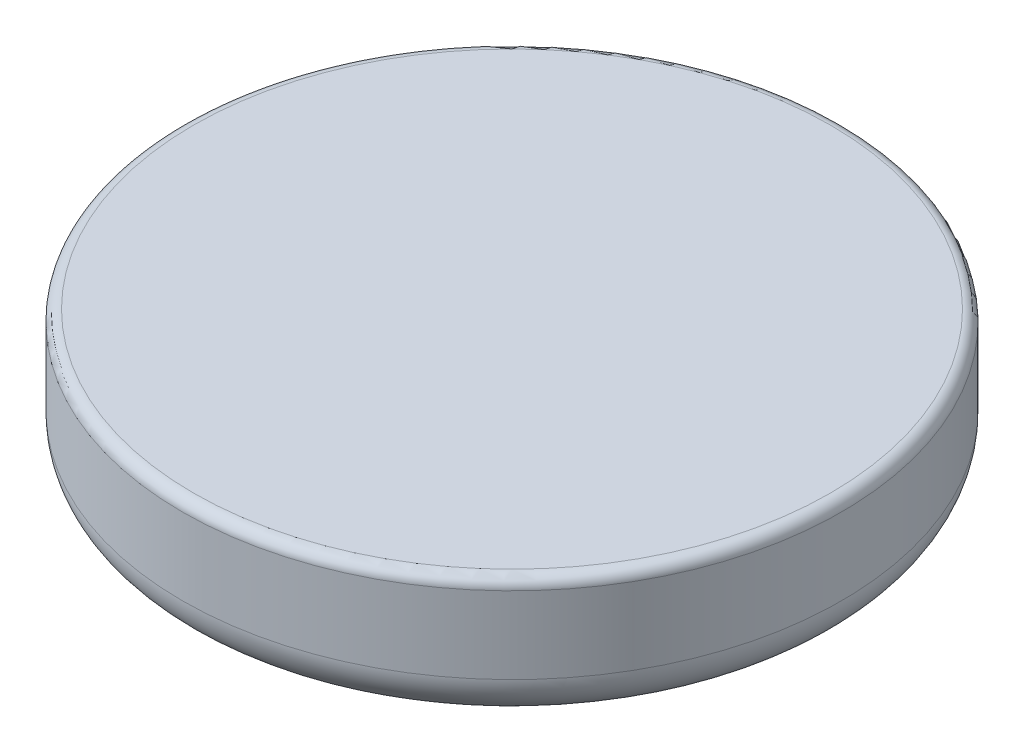
ISO-10303-21;
HEADER;
FILE_DESCRIPTION(('STEP AP214'),'2;1');
FILE_NAME('part.step','',(''),(''),'','','');
FILE_SCHEMA(('AUTOMOTIVE_DESIGN { 1 0 10303 214 1 1 1 1 }'));
ENDSEC;
DATA;
#1=APPLICATION_CONTEXT('core data for automotive mechanical design processes');
#2=APPLICATION_PROTOCOL_DEFINITION('international standard','automotive_design',2000,#1);
#3=PRODUCT_CONTEXT('',#1,'mechanical');
#4=PRODUCT('Part','Part','',(#3));
#5=PRODUCT_RELATED_PRODUCT_CATEGORY('part','',(#4));
#6=PRODUCT_DEFINITION_FORMATION('','',#4);
#7=PRODUCT_DEFINITION_CONTEXT('part definition',#1,'design');
#8=PRODUCT_DEFINITION('design','',#6,#7);
#9=PRODUCT_DEFINITION_SHAPE('','',#8);
#10=(LENGTH_UNIT() NAMED_UNIT(*) SI_UNIT(.MILLI.,.METRE.));
#11=(NAMED_UNIT(*) PLANE_ANGLE_UNIT() SI_UNIT($,.RADIAN.));
#12=(NAMED_UNIT(*) SI_UNIT($,.STERADIAN.) SOLID_ANGLE_UNIT());
#13=UNCERTAINTY_MEASURE_WITH_UNIT(LENGTH_MEASURE(1.E-05),#10,'distance_accuracy_value','');
#14=(GEOMETRIC_REPRESENTATION_CONTEXT(3) GLOBAL_UNCERTAINTY_ASSIGNED_CONTEXT((#13)) GLOBAL_UNIT_ASSIGNED_CONTEXT((#10,
#11,#12)) REPRESENTATION_CONTEXT('',''));
#15=CARTESIAN_POINT('',(0.,0.,0.));
#16=DIRECTION('',(0.,0.,1.));
#17=DIRECTION('',(1.,0.,0.));
#18=AXIS2_PLACEMENT_3D('',#15,#16,#17);
#19=CARTESIAN_POINT('',(0.,3.,0.));
#20=DIRECTION('',(0.,-1.,0.));
#21=DIRECTION('',(0.,0.,-1.));
#22=AXIS2_PLACEMENT_3D('',#19,#20,#21);
#23=CYLINDRICAL_SURFACE('',#22,7.5);
#24=CARTESIAN_POINT('',(0.,2.75,0.));
#25=DIRECTION('',(0.,1.,0.));
#26=DIRECTION('',(0.,0.,1.));
#27=AXIS2_PLACEMENT_3D('',#24,#25,#26);
#28=CIRCLE('',#27,7.5);
#29=CARTESIAN_POINT('',(0.,2.75,7.5));
#30=VERTEX_POINT('',#29);
#31=EDGE_CURVE('E350',#30,#30,#28,.F.);
#32=ORIENTED_EDGE('',*,*,#31,.T.);
#33=EDGE_LOOP('',(#32));
#34=FACE_BOUND('',#33,.T.);
#35=CARTESIAN_POINT('',(0.,1.,0.));
#36=DIRECTION('',(0.,1.,0.));
#37=DIRECTION('',(0.,0.,1.));
#38=AXIS2_PLACEMENT_3D('',#35,#36,#37);
#39=CIRCLE('',#38,7.5);
#40=CARTESIAN_POINT('',(0.,1.,7.5));
#41=VERTEX_POINT('',#40);
#42=EDGE_CURVE('E253',#41,#41,#39,.T.);
#43=ORIENTED_EDGE('',*,*,#42,.T.);
#44=EDGE_LOOP('',(#43));
#45=FACE_BOUND('',#44,.T.);
#46=ADVANCED_FACE('F43',(#34,#45),#23,.T.);
#47=CARTESIAN_POINT('',(0.,3.,0.));
#48=DIRECTION('',(0.,1.,0.));
#49=DIRECTION('',(0.,0.,1.));
#50=AXIS2_PLACEMENT_3D('',#47,#48,#49);
#51=PLANE('',#50);
#52=CARTESIAN_POINT('',(0.,3.,0.));
#53=DIRECTION('',(0.,1.,0.));
#54=DIRECTION('',(0.,0.,1.));
#55=AXIS2_PLACEMENT_3D('',#52,#53,#54);
#56=CIRCLE('',#55,7.25);
#57=CARTESIAN_POINT('',(0.,3.,7.25));
#58=VERTEX_POINT('',#57);
#59=EDGE_CURVE('E346',#58,#58,#56,.T.);
#60=ORIENTED_EDGE('',*,*,#59,.T.);
#61=EDGE_LOOP('',(#60));
#62=FACE_BOUND('',#61,.T.);
#63=ADVANCED_FACE('F459',(#62),#51,.T.);
#64=CARTESIAN_POINT('',(0.,0.,0.));
#65=DIRECTION('',(0.,1.,0.));
#66=DIRECTION('',(0.,0.,1.));
#67=AXIS2_PLACEMENT_3D('',#64,#65,#66);
#68=PLANE('',#67);
#69=DIRECTION('',(0.,0.,1.));
#70=VECTOR('',#69,1.);
#71=CARTESIAN_POINT('',(2.55,0.,0.700000000000001));
#72=LINE('',#71,#70);
#73=CARTESIAN_POINT('',(2.55,0.,-0.95));
#74=VERTEX_POINT('',#73);
#75=CARTESIAN_POINT('',(2.55,0.,0.950000000000001));
#76=VERTEX_POINT('',#75);
#77=EDGE_CURVE('E244',#74,#76,#72,.T.);
#78=ORIENTED_EDGE('',*,*,#77,.F.);
#79=DIRECTION('',(1.,0.,0.));
#80=VECTOR('',#79,1.);
#81=CARTESIAN_POINT('',(0.,0.,-0.95));
#82=LINE('',#81,#80);
#83=CARTESIAN_POINT('',(0.95,0.,-0.95));
#84=VERTEX_POINT('',#83);
#85=EDGE_CURVE('E325',#74,#84,#82,.F.);
#86=ORIENTED_EDGE('',*,*,#85,.T.);
#87=DIRECTION('',(0.,0.,1.));
#88=VECTOR('',#87,1.);
#89=CARTESIAN_POINT('',(0.95,0.,0.));
#90=LINE('',#89,#88);
#91=CARTESIAN_POINT('',(0.95,0.,-2.55));
#92=VERTEX_POINT('',#91);
#93=EDGE_CURVE('E321',#84,#92,#90,.F.);
#94=ORIENTED_EDGE('',*,*,#93,.T.);
#95=DIRECTION('',(1.,0.,0.));
#96=VECTOR('',#95,1.);
#97=CARTESIAN_POINT('',(0.7,0.,-2.55));
#98=LINE('',#97,#96);
#99=CARTESIAN_POINT('',(-0.95,0.,-2.55));
#100=VERTEX_POINT('',#99);
#101=EDGE_CURVE('E241',#100,#92,#98,.T.);
#102=ORIENTED_EDGE('',*,*,#101,.F.);
#103=DIRECTION('',(0.,0.,-1.));
#104=VECTOR('',#103,1.);
#105=CARTESIAN_POINT('',(-0.95,0.,0.));
#106=LINE('',#105,#104);
#107=CARTESIAN_POINT('',(-0.95,0.,-0.95));
#108=VERTEX_POINT('',#107);
#109=EDGE_CURVE('E314',#100,#108,#106,.F.);
#110=ORIENTED_EDGE('',*,*,#109,.T.);
#111=DIRECTION('',(1.,0.,0.));
#112=VECTOR('',#111,1.);
#113=CARTESIAN_POINT('',(0.,0.,-0.95));
#114=LINE('',#113,#112);
#115=CARTESIAN_POINT('',(-2.55,0.,-0.95));
#116=VERTEX_POINT('',#115);
#117=EDGE_CURVE('E317',#108,#116,#114,.F.);
#118=ORIENTED_EDGE('',*,*,#117,.T.);
#119=DIRECTION('',(0.,0.,-1.));
#120=VECTOR('',#119,1.);
#121=CARTESIAN_POINT('',(-2.55,0.,0.700000000000001));
#122=LINE('',#121,#120);
#123=CARTESIAN_POINT('',(-2.55,0.,0.950000000000001));
#124=VERTEX_POINT('',#123);
#125=EDGE_CURVE('E200',#124,#116,#122,.T.);
#126=ORIENTED_EDGE('',*,*,#125,.F.);
#127=DIRECTION('',(-1.,0.,0.));
#128=VECTOR('',#127,1.);
#129=CARTESIAN_POINT('',(0.,0.,0.950000000000001));
#130=LINE('',#129,#128);
#131=CARTESIAN_POINT('',(-0.95,0.,0.950000000000001));
#132=VERTEX_POINT('',#131);
#133=EDGE_CURVE('E311',#124,#132,#130,.F.);
#134=ORIENTED_EDGE('',*,*,#133,.T.);
#135=DIRECTION('',(0.,0.,-1.));
#136=VECTOR('',#135,1.);
#137=CARTESIAN_POINT('',(-0.95,0.,0.));
#138=LINE('',#137,#136);
#139=CARTESIAN_POINT('',(-0.950000000000001,0.,2.55));
#140=VERTEX_POINT('',#139);
#141=EDGE_CURVE('E307',#132,#140,#138,.F.);
#142=ORIENTED_EDGE('',*,*,#141,.T.);
#143=DIRECTION('',(-1.,0.,0.));
#144=VECTOR('',#143,1.);
#145=CARTESIAN_POINT('',(0.7,0.,2.55));
#146=LINE('',#145,#144);
#147=CARTESIAN_POINT('',(0.95,0.,2.55));
#148=VERTEX_POINT('',#147);
#149=EDGE_CURVE('E203',#148,#140,#146,.T.);
#150=ORIENTED_EDGE('',*,*,#149,.F.);
#151=DIRECTION('',(0.,0.,1.));
#152=VECTOR('',#151,1.);
#153=CARTESIAN_POINT('',(0.95,0.,0.));
#154=LINE('',#153,#152);
#155=CARTESIAN_POINT('',(0.95,0.,0.950000000000001));
#156=VERTEX_POINT('',#155);
#157=EDGE_CURVE('E300',#148,#156,#154,.F.);
#158=ORIENTED_EDGE('',*,*,#157,.T.);
#159=DIRECTION('',(-1.,0.,0.));
#160=VECTOR('',#159,1.);
#161=CARTESIAN_POINT('',(0.,0.,0.950000000000001));
#162=LINE('',#161,#160);
#163=EDGE_CURVE('E303',#156,#76,#162,.F.);
#164=ORIENTED_EDGE('',*,*,#163,.T.);
#165=EDGE_LOOP('',(#78,#86,#94,#102,#110,#118,#126,#134,#142,#150,#158,#164));
#166=FACE_BOUND('',#165,.T.);
#167=CARTESIAN_POINT('',(0.,0.,0.));
#168=DIRECTION('',(0.,1.,0.));
#169=DIRECTION('',(0.,0.,1.));
#170=AXIS2_PLACEMENT_3D('',#167,#168,#169);
#171=CIRCLE('',#170,6.5);
#172=CARTESIAN_POINT('',(0.,0.,6.5));
#173=VERTEX_POINT('',#172);
#174=EDGE_CURVE('E292',#173,#173,#171,.F.);
#175=ORIENTED_EDGE('',*,*,#174,.T.);
#176=EDGE_LOOP('',(#175));
#177=FACE_BOUND('',#176,.T.);
#178=ADVANCED_FACE('F403',(#166,#177),#68,.F.);
#179=CARTESIAN_POINT('',(0.,1.,0.));
#180=DIRECTION('',(0.,1.,0.));
#181=DIRECTION('',(0.,0.,1.));
#182=AXIS2_PLACEMENT_3D('',#179,#180,#181);
#183=TOROIDAL_SURFACE('',#182,6.5,1.);
#184=ORIENTED_EDGE('',*,*,#174,.F.);
#185=EDGE_LOOP('',(#184));
#186=FACE_BOUND('',#185,.T.);
#187=ORIENTED_EDGE('',*,*,#42,.F.);
#188=EDGE_LOOP('',(#187));
#189=FACE_BOUND('',#188,.T.);
#190=ADVANCED_FACE('F469',(#186,#189),#183,.T.);
#191=CARTESIAN_POINT('',(0.7,2.,-2.55));
#192=DIRECTION('',(0.,0.,-1.));
#193=DIRECTION('',(-1.,0.,0.));
#194=AXIS2_PLACEMENT_3D('',#191,#192,#193);
#195=PLANE('',#194);
#196=ORIENTED_EDGE('',*,*,#101,.T.);
#197=CARTESIAN_POINT('',(0.95,0.25,-2.55));
#198=DIRECTION('',(0.,0.,-1.));
#199=DIRECTION('',(-1.,0.,0.));
#200=AXIS2_PLACEMENT_3D('',#197,#198,#199);
#201=CIRCLE('',#200,0.25);
#202=CARTESIAN_POINT('',(0.7,0.25,-2.55));
#203=VERTEX_POINT('',#202);
#204=EDGE_CURVE('E179',#92,#203,#201,.T.);
#205=ORIENTED_EDGE('',*,*,#204,.T.);
#206=DIRECTION('',(0.,-1.,0.));
#207=VECTOR('',#206,1.);
#208=CARTESIAN_POINT('',(0.7,2.,-2.55));
#209=LINE('',#208,#207);
#210=CARTESIAN_POINT('',(0.7,2.,-2.55));
#211=VERTEX_POINT('',#210);
#212=EDGE_CURVE('E171',#211,#203,#209,.T.);
#213=ORIENTED_EDGE('',*,*,#212,.F.);
#214=DIRECTION('',(1.,0.,0.));
#215=VECTOR('',#214,1.);
#216=CARTESIAN_POINT('',(0.7,2.,-2.55));
#217=LINE('',#216,#215);
#218=CARTESIAN_POINT('',(-0.7,2.,-2.55));
#219=VERTEX_POINT('',#218);
#220=EDGE_CURVE('E176',#219,#211,#217,.T.);
#221=ORIENTED_EDGE('',*,*,#220,.F.);
#222=DIRECTION('',(0.,-1.,0.));
#223=VECTOR('',#222,1.);
#224=CARTESIAN_POINT('',(-0.7,2.,-2.55));
#225=LINE('',#224,#223);
#226=CARTESIAN_POINT('',(-0.7,0.25,-2.55));
#227=VERTEX_POINT('',#226);
#228=EDGE_CURVE('E250',#219,#227,#225,.T.);
#229=ORIENTED_EDGE('',*,*,#228,.T.);
#230=CARTESIAN_POINT('',(-0.95,0.25,-2.55));
#231=DIRECTION('',(0.,0.,-1.));
#232=DIRECTION('',(-1.,0.,0.));
#233=AXIS2_PLACEMENT_3D('',#230,#231,#232);
#234=CIRCLE('',#233,0.25);
#235=EDGE_CURVE('E375',#227,#100,#234,.T.);
#236=ORIENTED_EDGE('',*,*,#235,.T.);
#237=EDGE_LOOP('',(#196,#205,#213,#221,#229,#236));
#238=FACE_BOUND('',#237,.T.);
#239=ADVANCED_FACE('F173',(#238),#195,.F.);
#240=CARTESIAN_POINT('',(-0.7,2.,-0.7));
#241=DIRECTION('',(-1.,0.,0.));
#242=DIRECTION('',(0.,0.,1.));
#243=AXIS2_PLACEMENT_3D('',#240,#241,#242);
#244=PLANE('',#243);
#245=DIRECTION('',(0.,-1.,0.));
#246=VECTOR('',#245,1.);
#247=CARTESIAN_POINT('',(-0.7,2.,-0.7));
#248=LINE('',#247,#246);
#249=CARTESIAN_POINT('',(-0.7,2.,-0.7));
#250=VERTEX_POINT('',#249);
#251=CARTESIAN_POINT('',(-0.7,0.25,-0.7));
#252=VERTEX_POINT('',#251);
#253=EDGE_CURVE('E254',#250,#252,#248,.T.);
#254=ORIENTED_EDGE('',*,*,#253,.T.);
#255=DIRECTION('',(0.,0.,-1.));
#256=VECTOR('',#255,1.);
#257=CARTESIAN_POINT('',(-0.7,0.25,-0.7));
#258=LINE('',#257,#256);
#259=EDGE_CURVE('E343',#252,#227,#258,.T.);
#260=ORIENTED_EDGE('',*,*,#259,.T.);
#261=ORIENTED_EDGE('',*,*,#228,.F.);
#262=DIRECTION('',(0.,0.,-1.));
#263=VECTOR('',#262,1.);
#264=CARTESIAN_POINT('',(-0.7,2.,-0.7));
#265=LINE('',#264,#263);
#266=EDGE_CURVE('E184',#250,#219,#265,.T.);
#267=ORIENTED_EDGE('',*,*,#266,.F.);
#268=EDGE_LOOP('',(#254,#260,#261,#267));
#269=FACE_BOUND('',#268,.T.);
#270=ADVANCED_FACE('F436',(#269),#244,.F.);
#271=CARTESIAN_POINT('',(-0.7,2.,-0.7));
#272=DIRECTION('',(0.,0.,-1.));
#273=DIRECTION('',(-1.,0.,0.));
#274=AXIS2_PLACEMENT_3D('',#271,#272,#273);
#275=PLANE('',#274);
#276=DIRECTION('',(0.,-1.,0.));
#277=VECTOR('',#276,1.);
#278=CARTESIAN_POINT('',(-2.55,2.,-0.7));
#279=LINE('',#278,#277);
#280=CARTESIAN_POINT('',(-2.55,2.,-0.7));
#281=VERTEX_POINT('',#280);
#282=CARTESIAN_POINT('',(-2.55,0.25,-0.7));
#283=VERTEX_POINT('',#282);
#284=EDGE_CURVE('E258',#281,#283,#279,.T.);
#285=ORIENTED_EDGE('',*,*,#284,.T.);
#286=DIRECTION('',(1.,0.,0.));
#287=VECTOR('',#286,1.);
#288=CARTESIAN_POINT('',(-0.7,0.25,-0.7));
#289=LINE('',#288,#287);
#290=EDGE_CURVE('E296',#283,#252,#289,.T.);
#291=ORIENTED_EDGE('',*,*,#290,.T.);
#292=ORIENTED_EDGE('',*,*,#253,.F.);
#293=DIRECTION('',(1.,0.,0.));
#294=VECTOR('',#293,1.);
#295=CARTESIAN_POINT('',(-0.7,2.,-0.7));
#296=LINE('',#295,#294);
#297=EDGE_CURVE('E236',#281,#250,#296,.T.);
#298=ORIENTED_EDGE('',*,*,#297,.F.);
#299=EDGE_LOOP('',(#285,#291,#292,#298));
#300=FACE_BOUND('',#299,.T.);
#301=ADVANCED_FACE('F434',(#300),#275,.F.);
#302=CARTESIAN_POINT('',(-2.55,2.,0.700000000000001));
#303=DIRECTION('',(-1.,0.,0.));
#304=DIRECTION('',(0.,0.,1.));
#305=AXIS2_PLACEMENT_3D('',#302,#303,#304);
#306=PLANE('',#305);
#307=ORIENTED_EDGE('',*,*,#125,.T.);
#308=CARTESIAN_POINT('',(-2.55,0.25,-0.95));
#309=DIRECTION('',(-1.,0.,0.));
#310=DIRECTION('',(0.,0.,1.));
#311=AXIS2_PLACEMENT_3D('',#308,#309,#310);
#312=CIRCLE('',#311,0.25);
#313=EDGE_CURVE('E359',#116,#283,#312,.T.);
#314=ORIENTED_EDGE('',*,*,#313,.T.);
#315=ORIENTED_EDGE('',*,*,#284,.F.);
#316=DIRECTION('',(0.,0.,-1.));
#317=VECTOR('',#316,1.);
#318=CARTESIAN_POINT('',(-2.55,2.,0.700000000000001));
#319=LINE('',#318,#317);
#320=CARTESIAN_POINT('',(-2.55,2.,0.700000000000001));
#321=VERTEX_POINT('',#320);
#322=EDGE_CURVE('E232',#321,#281,#319,.T.);
#323=ORIENTED_EDGE('',*,*,#322,.F.);
#324=DIRECTION('',(0.,-1.,0.));
#325=VECTOR('',#324,1.);
#326=CARTESIAN_POINT('',(-2.55,2.,0.700000000000001));
#327=LINE('',#326,#325);
#328=CARTESIAN_POINT('',(-2.55,0.25,0.700000000000001));
#329=VERTEX_POINT('',#328);
#330=EDGE_CURVE('E262',#321,#329,#327,.T.);
#331=ORIENTED_EDGE('',*,*,#330,.T.);
#332=CARTESIAN_POINT('',(-2.55,0.25,0.950000000000001));
#333=DIRECTION('',(-1.,0.,0.));
#334=DIRECTION('',(0.,0.,1.));
#335=AXIS2_PLACEMENT_3D('',#332,#333,#334);
#336=CIRCLE('',#335,0.25);
#337=EDGE_CURVE('E362',#329,#124,#336,.T.);
#338=ORIENTED_EDGE('',*,*,#337,.T.);
#339=EDGE_LOOP('',(#307,#314,#315,#323,#331,#338));
#340=FACE_BOUND('',#339,.T.);
#341=ADVANCED_FACE('F430',(#340),#306,.F.);
#342=CARTESIAN_POINT('',(-0.7,2.,0.700000000000001));
#343=DIRECTION('',(0.,0.,1.));
#344=DIRECTION('',(1.,0.,0.));
#345=AXIS2_PLACEMENT_3D('',#342,#343,#344);
#346=PLANE('',#345);
#347=DIRECTION('',(0.,-1.,0.));
#348=VECTOR('',#347,1.);
#349=CARTESIAN_POINT('',(-0.7,2.,0.700000000000001));
#350=LINE('',#349,#348);
#351=CARTESIAN_POINT('',(-0.7,2.,0.700000000000001));
#352=VERTEX_POINT('',#351);
#353=CARTESIAN_POINT('',(-0.7,0.25,0.700000000000001));
#354=VERTEX_POINT('',#353);
#355=EDGE_CURVE('E266',#352,#354,#350,.T.);
#356=ORIENTED_EDGE('',*,*,#355,.T.);
#357=DIRECTION('',(-1.,0.,0.));
#358=VECTOR('',#357,1.);
#359=CARTESIAN_POINT('',(-0.7,0.25,0.700000000000001));
#360=LINE('',#359,#358);
#361=EDGE_CURVE('E328',#354,#329,#360,.T.);
#362=ORIENTED_EDGE('',*,*,#361,.T.);
#363=ORIENTED_EDGE('',*,*,#330,.F.);
#364=DIRECTION('',(-1.,0.,0.));
#365=VECTOR('',#364,1.);
#366=CARTESIAN_POINT('',(-0.7,2.,0.700000000000001));
#367=LINE('',#366,#365);
#368=EDGE_CURVE('E228',#352,#321,#367,.T.);
#369=ORIENTED_EDGE('',*,*,#368,.F.);
#370=EDGE_LOOP('',(#356,#362,#363,#369));
#371=FACE_BOUND('',#370,.T.);
#372=ADVANCED_FACE('F426',(#371),#346,.F.);
#373=CARTESIAN_POINT('',(-0.700000000000001,2.,2.55));
#374=DIRECTION('',(-1.,0.,0.));
#375=DIRECTION('',(0.,0.,1.));
#376=AXIS2_PLACEMENT_3D('',#373,#374,#375);
#377=PLANE('',#376);
#378=DIRECTION('',(0.,-1.,0.));
#379=VECTOR('',#378,1.);
#380=CARTESIAN_POINT('',(-0.700000000000001,2.,2.55));
#381=LINE('',#380,#379);
#382=CARTESIAN_POINT('',(-0.700000000000001,2.,2.55));
#383=VERTEX_POINT('',#382);
#384=CARTESIAN_POINT('',(-0.700000000000001,0.25,2.55));
#385=VERTEX_POINT('',#384);
#386=EDGE_CURVE('E270',#383,#385,#381,.T.);
#387=ORIENTED_EDGE('',*,*,#386,.T.);
#388=DIRECTION('',(0.,0.,-1.));
#389=VECTOR('',#388,1.);
#390=CARTESIAN_POINT('',(-0.700000000000001,0.25,2.55));
#391=LINE('',#390,#389);
#392=EDGE_CURVE('E354',#385,#354,#391,.T.);
#393=ORIENTED_EDGE('',*,*,#392,.T.);
#394=ORIENTED_EDGE('',*,*,#355,.F.);
#395=DIRECTION('',(0.,0.,-1.));
#396=VECTOR('',#395,1.);
#397=CARTESIAN_POINT('',(-0.700000000000001,2.,2.55));
#398=LINE('',#397,#396);
#399=EDGE_CURVE('E224',#383,#352,#398,.T.);
#400=ORIENTED_EDGE('',*,*,#399,.F.);
#401=EDGE_LOOP('',(#387,#393,#394,#400));
#402=FACE_BOUND('',#401,.T.);
#403=ADVANCED_FACE('F422',(#402),#377,.F.);
#404=CARTESIAN_POINT('',(0.7,2.,2.55));
#405=DIRECTION('',(0.,0.,1.));
#406=DIRECTION('',(1.,0.,0.));
#407=AXIS2_PLACEMENT_3D('',#404,#405,#406);
#408=PLANE('',#407);
#409=ORIENTED_EDGE('',*,*,#149,.T.);
#410=CARTESIAN_POINT('',(-0.950000000000001,0.25,2.55));
#411=DIRECTION('',(0.,0.,1.));
#412=DIRECTION('',(1.,0.,0.));
#413=AXIS2_PLACEMENT_3D('',#410,#411,#412);
#414=CIRCLE('',#413,0.25);
#415=EDGE_CURVE('E53',#140,#385,#414,.T.);
#416=ORIENTED_EDGE('',*,*,#415,.T.);
#417=ORIENTED_EDGE('',*,*,#386,.F.);
#418=DIRECTION('',(-1.,0.,0.));
#419=VECTOR('',#418,1.);
#420=CARTESIAN_POINT('',(0.7,2.,2.55));
#421=LINE('',#420,#419);
#422=CARTESIAN_POINT('',(0.7,2.,2.55));
#423=VERTEX_POINT('',#422);
#424=EDGE_CURVE('E220',#423,#383,#421,.T.);
#425=ORIENTED_EDGE('',*,*,#424,.F.);
#426=DIRECTION('',(0.,-1.,0.));
#427=VECTOR('',#426,1.);
#428=CARTESIAN_POINT('',(0.7,2.,2.55));
#429=LINE('',#428,#427);
#430=CARTESIAN_POINT('',(0.7,0.25,2.55));
#431=VERTEX_POINT('',#430);
#432=EDGE_CURVE('E273',#423,#431,#429,.T.);
#433=ORIENTED_EDGE('',*,*,#432,.T.);
#434=CARTESIAN_POINT('',(0.95,0.25,2.55));
#435=DIRECTION('',(0.,0.,1.));
#436=DIRECTION('',(1.,0.,0.));
#437=AXIS2_PLACEMENT_3D('',#434,#435,#436);
#438=CIRCLE('',#437,0.25);
#439=EDGE_CURVE('E11',#431,#148,#438,.T.);
#440=ORIENTED_EDGE('',*,*,#439,.T.);
#441=EDGE_LOOP('',(#409,#416,#417,#425,#433,#440));
#442=FACE_BOUND('',#441,.T.);
#443=ADVANCED_FACE('F418',(#442),#408,.F.);
#444=CARTESIAN_POINT('',(0.7,2.,2.55));
#445=DIRECTION('',(1.,0.,0.));
#446=DIRECTION('',(0.,0.,-1.));
#447=AXIS2_PLACEMENT_3D('',#444,#445,#446);
#448=PLANE('',#447);
#449=DIRECTION('',(0.,-1.,0.));
#450=VECTOR('',#449,1.);
#451=CARTESIAN_POINT('',(0.7,2.,0.700000000000001));
#452=LINE('',#451,#450);
#453=CARTESIAN_POINT('',(0.7,2.,0.700000000000001));
#454=VERTEX_POINT('',#453);
#455=CARTESIAN_POINT('',(0.7,0.25,0.700000000000001));
#456=VERTEX_POINT('',#455);
#457=EDGE_CURVE('E276',#454,#456,#452,.T.);
#458=ORIENTED_EDGE('',*,*,#457,.T.);
#459=DIRECTION('',(0.,0.,1.));
#460=VECTOR('',#459,1.);
#461=CARTESIAN_POINT('',(0.7,0.25,2.55));
#462=LINE('',#461,#460);
#463=EDGE_CURVE('E61',#456,#431,#462,.T.);
#464=ORIENTED_EDGE('',*,*,#463,.T.);
#465=ORIENTED_EDGE('',*,*,#432,.F.);
#466=DIRECTION('',(0.,0.,1.));
#467=VECTOR('',#466,1.);
#468=CARTESIAN_POINT('',(0.7,2.,2.55));
#469=LINE('',#468,#467);
#470=EDGE_CURVE('E216',#454,#423,#469,.T.);
#471=ORIENTED_EDGE('',*,*,#470,.F.);
#472=EDGE_LOOP('',(#458,#464,#465,#471));
#473=FACE_BOUND('',#472,.T.);
#474=ADVANCED_FACE('F415',(#473),#448,.F.);
#475=CARTESIAN_POINT('',(2.55,2.,0.700000000000001));
#476=DIRECTION('',(0.,0.,1.));
#477=DIRECTION('',(1.,0.,0.));
#478=AXIS2_PLACEMENT_3D('',#475,#476,#477);
#479=PLANE('',#478);
#480=DIRECTION('',(0.,-1.,0.));
#481=VECTOR('',#480,1.);
#482=CARTESIAN_POINT('',(2.55,2.,0.700000000000001));
#483=LINE('',#482,#481);
#484=CARTESIAN_POINT('',(2.55,2.,0.700000000000001));
#485=VERTEX_POINT('',#484);
#486=CARTESIAN_POINT('',(2.55,0.25,0.700000000000001));
#487=VERTEX_POINT('',#486);
#488=EDGE_CURVE('E279',#485,#487,#483,.T.);
#489=ORIENTED_EDGE('',*,*,#488,.T.);
#490=DIRECTION('',(-1.,0.,0.));
#491=VECTOR('',#490,1.);
#492=CARTESIAN_POINT('',(2.55,0.25,0.700000000000001));
#493=LINE('',#492,#491);
#494=EDGE_CURVE('E332',#487,#456,#493,.T.);
#495=ORIENTED_EDGE('',*,*,#494,.T.);
#496=ORIENTED_EDGE('',*,*,#457,.F.);
#497=DIRECTION('',(-1.,0.,0.));
#498=VECTOR('',#497,1.);
#499=CARTESIAN_POINT('',(2.55,2.,0.700000000000001));
#500=LINE('',#499,#498);
#501=EDGE_CURVE('E212',#485,#454,#500,.T.);
#502=ORIENTED_EDGE('',*,*,#501,.F.);
#503=EDGE_LOOP('',(#489,#495,#496,#502));
#504=FACE_BOUND('',#503,.T.);
#505=ADVANCED_FACE('F413',(#504),#479,.F.);
#506=CARTESIAN_POINT('',(2.55,2.,0.700000000000001));
#507=DIRECTION('',(1.,0.,0.));
#508=DIRECTION('',(0.,0.,-1.));
#509=AXIS2_PLACEMENT_3D('',#506,#507,#508);
#510=PLANE('',#509);
#511=ORIENTED_EDGE('',*,*,#77,.T.);
#512=CARTESIAN_POINT('',(2.55,0.25,0.950000000000001));
#513=DIRECTION('',(1.,0.,0.));
#514=DIRECTION('',(0.,0.,-1.));
#515=AXIS2_PLACEMENT_3D('',#512,#513,#514);
#516=CIRCLE('',#515,0.25);
#517=EDGE_CURVE('E366',#76,#487,#516,.T.);
#518=ORIENTED_EDGE('',*,*,#517,.T.);
#519=ORIENTED_EDGE('',*,*,#488,.F.);
#520=DIRECTION('',(0.,0.,1.));
#521=VECTOR('',#520,1.);
#522=CARTESIAN_POINT('',(2.55,2.,0.700000000000001));
#523=LINE('',#522,#521);
#524=CARTESIAN_POINT('',(2.55,2.,-0.7));
#525=VERTEX_POINT('',#524);
#526=EDGE_CURVE('E208',#525,#485,#523,.T.);
#527=ORIENTED_EDGE('',*,*,#526,.F.);
#528=DIRECTION('',(0.,-1.,0.));
#529=VECTOR('',#528,1.);
#530=CARTESIAN_POINT('',(2.55,2.,-0.7));
#531=LINE('',#530,#529);
#532=CARTESIAN_POINT('',(2.55,0.25,-0.7));
#533=VERTEX_POINT('',#532);
#534=EDGE_CURVE('E283',#525,#533,#531,.T.);
#535=ORIENTED_EDGE('',*,*,#534,.T.);
#536=CARTESIAN_POINT('',(2.55,0.25,-0.95));
#537=DIRECTION('',(1.,0.,0.));
#538=DIRECTION('',(0.,0.,-1.));
#539=AXIS2_PLACEMENT_3D('',#536,#537,#538);
#540=CIRCLE('',#539,0.25);
#541=EDGE_CURVE('E369',#533,#74,#540,.T.);
#542=ORIENTED_EDGE('',*,*,#541,.T.);
#543=EDGE_LOOP('',(#511,#518,#519,#527,#535,#542));
#544=FACE_BOUND('',#543,.T.);
#545=ADVANCED_FACE('F407',(#544),#510,.F.);
#546=CARTESIAN_POINT('',(2.55,2.,-0.7));
#547=DIRECTION('',(0.,0.,-1.));
#548=DIRECTION('',(-1.,0.,0.));
#549=AXIS2_PLACEMENT_3D('',#546,#547,#548);
#550=PLANE('',#549);
#551=DIRECTION('',(0.,-1.,0.));
#552=VECTOR('',#551,1.);
#553=CARTESIAN_POINT('',(0.7,2.,-0.7));
#554=LINE('',#553,#552);
#555=CARTESIAN_POINT('',(0.7,2.,-0.7));
#556=VERTEX_POINT('',#555);
#557=CARTESIAN_POINT('',(0.7,0.25,-0.7));
#558=VERTEX_POINT('',#557);
#559=EDGE_CURVE('E183',#556,#558,#554,.T.);
#560=ORIENTED_EDGE('',*,*,#559,.T.);
#561=DIRECTION('',(1.,0.,0.));
#562=VECTOR('',#561,1.);
#563=CARTESIAN_POINT('',(2.55,0.25,-0.7));
#564=LINE('',#563,#562);
#565=EDGE_CURVE('E336',#558,#533,#564,.T.);
#566=ORIENTED_EDGE('',*,*,#565,.T.);
#567=ORIENTED_EDGE('',*,*,#534,.F.);
#568=DIRECTION('',(1.,0.,0.));
#569=VECTOR('',#568,1.);
#570=CARTESIAN_POINT('',(2.55,2.,-0.7));
#571=LINE('',#570,#569);
#572=EDGE_CURVE('E194',#556,#525,#571,.T.);
#573=ORIENTED_EDGE('',*,*,#572,.F.);
#574=EDGE_LOOP('',(#560,#566,#567,#573));
#575=FACE_BOUND('',#574,.T.);
#576=ADVANCED_FACE('F410',(#575),#550,.F.);
#577=CARTESIAN_POINT('',(0.7,2.,-0.7));
#578=DIRECTION('',(1.,0.,0.));
#579=DIRECTION('',(0.,0.,-1.));
#580=AXIS2_PLACEMENT_3D('',#577,#578,#579);
#581=PLANE('',#580);
#582=ORIENTED_EDGE('',*,*,#212,.T.);
#583=DIRECTION('',(0.,0.,1.));
#584=VECTOR('',#583,1.);
#585=CARTESIAN_POINT('',(0.7,0.25,-0.7));
#586=LINE('',#585,#584);
#587=EDGE_CURVE('E340',#203,#558,#586,.T.);
#588=ORIENTED_EDGE('',*,*,#587,.T.);
#589=ORIENTED_EDGE('',*,*,#559,.F.);
#590=DIRECTION('',(0.,0.,1.));
#591=VECTOR('',#590,1.);
#592=CARTESIAN_POINT('',(0.7,2.,-0.7));
#593=LINE('',#592,#591);
#594=EDGE_CURVE('E187',#211,#556,#593,.T.);
#595=ORIENTED_EDGE('',*,*,#594,.F.);
#596=EDGE_LOOP('',(#582,#588,#589,#595));
#597=FACE_BOUND('',#596,.T.);
#598=ADVANCED_FACE('F188',(#597),#581,.F.);
#599=CARTESIAN_POINT('',(0.,2.,0.));
#600=DIRECTION('',(0.,-1.,0.));
#601=DIRECTION('',(0.,0.,-1.));
#602=AXIS2_PLACEMENT_3D('',#599,#600,#601);
#603=PLANE('',#602);
#604=ORIENTED_EDGE('',*,*,#220,.T.);
#605=ORIENTED_EDGE('',*,*,#594,.T.);
#606=ORIENTED_EDGE('',*,*,#572,.T.);
#607=ORIENTED_EDGE('',*,*,#526,.T.);
#608=ORIENTED_EDGE('',*,*,#501,.T.);
#609=ORIENTED_EDGE('',*,*,#470,.T.);
#610=ORIENTED_EDGE('',*,*,#424,.T.);
#611=ORIENTED_EDGE('',*,*,#399,.T.);
#612=ORIENTED_EDGE('',*,*,#368,.T.);
#613=ORIENTED_EDGE('',*,*,#322,.T.);
#614=ORIENTED_EDGE('',*,*,#297,.T.);
#615=ORIENTED_EDGE('',*,*,#266,.T.);
#616=EDGE_LOOP('',(#604,#605,#606,#607,#608,#609,#610,#611,#612,#613,#614,#615));
#617=FACE_BOUND('',#616,.T.);
#618=ADVANCED_FACE('F196',(#617),#603,.T.);
#619=CARTESIAN_POINT('',(-0.95,0.25,-0.7));
#620=DIRECTION('',(0.,0.,-1.));
#621=DIRECTION('',(-1.,0.,0.));
#622=AXIS2_PLACEMENT_3D('',#619,#620,#621);
#623=CYLINDRICAL_SURFACE('',#622,0.25);
#624=ORIENTED_EDGE('',*,*,#235,.F.);
#625=ORIENTED_EDGE('',*,*,#259,.F.);
#626=CARTESIAN_POINT('',(-0.95,0.25,-0.95));
#627=DIRECTION('',(0.707106781186547,0.,-0.707106781186548));
#628=DIRECTION('',(-0.707106781186547,0.,-0.707106781186547));
#629=AXIS2_PLACEMENT_3D('',#626,#627,#628);
#630=ELLIPSE('',#629,0.353553390593274,0.25);
#631=EDGE_CURVE('E245',#108,#252,#630,.F.);
#632=ORIENTED_EDGE('',*,*,#631,.F.);
#633=ORIENTED_EDGE('',*,*,#109,.F.);
#634=EDGE_LOOP('',(#624,#625,#632,#633));
#635=FACE_BOUND('',#634,.T.);
#636=ADVANCED_FACE('F441',(#635),#623,.T.);
#637=CARTESIAN_POINT('',(-0.7,0.25,-0.95));
#638=DIRECTION('',(1.,0.,0.));
#639=DIRECTION('',(0.,0.,-1.));
#640=AXIS2_PLACEMENT_3D('',#637,#638,#639);
#641=CYLINDRICAL_SURFACE('',#640,0.25);
#642=ORIENTED_EDGE('',*,*,#313,.F.);
#643=ORIENTED_EDGE('',*,*,#117,.F.);
#644=ORIENTED_EDGE('',*,*,#631,.T.);
#645=ORIENTED_EDGE('',*,*,#290,.F.);
#646=EDGE_LOOP('',(#642,#643,#644,#645));
#647=FACE_BOUND('',#646,.T.);
#648=ADVANCED_FACE('F445',(#647),#641,.T.);
#649=CARTESIAN_POINT('',(-0.950000000000001,0.25,2.55));
#650=DIRECTION('',(0.,0.,-1.));
#651=DIRECTION('',(-1.,0.,0.));
#652=AXIS2_PLACEMENT_3D('',#649,#650,#651);
#653=CYLINDRICAL_SURFACE('',#652,0.25);
#654=ORIENTED_EDGE('',*,*,#415,.F.);
#655=ORIENTED_EDGE('',*,*,#141,.F.);
#656=CARTESIAN_POINT('',(-0.95,0.25,0.950000000000001));
#657=DIRECTION('',(-0.707106781186547,0.,-0.707106781186548));
#658=DIRECTION('',(0.707106781186548,0.,-0.707106781186547));
#659=AXIS2_PLACEMENT_3D('',#656,#657,#658);
#660=ELLIPSE('',#659,0.353553390593274,0.25);
#661=EDGE_CURVE('E383',#354,#132,#660,.T.);
#662=ORIENTED_EDGE('',*,*,#661,.F.);
#663=ORIENTED_EDGE('',*,*,#392,.F.);
#664=EDGE_LOOP('',(#654,#655,#662,#663));
#665=FACE_BOUND('',#664,.T.);
#666=ADVANCED_FACE('F447',(#665),#653,.T.);
#667=CARTESIAN_POINT('',(-0.7,0.25,0.950000000000001));
#668=DIRECTION('',(-1.,0.,0.));
#669=DIRECTION('',(0.,0.,1.));
#670=AXIS2_PLACEMENT_3D('',#667,#668,#669);
#671=CYLINDRICAL_SURFACE('',#670,0.25);
#672=ORIENTED_EDGE('',*,*,#661,.T.);
#673=ORIENTED_EDGE('',*,*,#133,.F.);
#674=ORIENTED_EDGE('',*,*,#337,.F.);
#675=ORIENTED_EDGE('',*,*,#361,.F.);
#676=EDGE_LOOP('',(#672,#673,#674,#675));
#677=FACE_BOUND('',#676,.T.);
#678=ADVANCED_FACE('F453',(#677),#671,.T.);
#679=CARTESIAN_POINT('',(0.95,0.25,2.55));
#680=DIRECTION('',(0.,0.,1.));
#681=DIRECTION('',(1.,0.,0.));
#682=AXIS2_PLACEMENT_3D('',#679,#680,#681);
#683=CYLINDRICAL_SURFACE('',#682,0.25);
#684=ORIENTED_EDGE('',*,*,#439,.F.);
#685=ORIENTED_EDGE('',*,*,#463,.F.);
#686=CARTESIAN_POINT('',(0.95,0.25,0.950000000000001));
#687=DIRECTION('',(-0.707106781186548,0.,0.707106781186547));
#688=DIRECTION('',(0.707106781186547,0.,0.707106781186548));
#689=AXIS2_PLACEMENT_3D('',#686,#687,#688);
#690=ELLIPSE('',#689,0.353553390593274,0.25);
#691=EDGE_CURVE('E386',#156,#456,#690,.F.);
#692=ORIENTED_EDGE('',*,*,#691,.F.);
#693=ORIENTED_EDGE('',*,*,#157,.F.);
#694=EDGE_LOOP('',(#684,#685,#692,#693));
#695=FACE_BOUND('',#694,.T.);
#696=ADVANCED_FACE('F645',(#695),#683,.T.);
#697=CARTESIAN_POINT('',(2.55,0.25,0.950000000000001));
#698=DIRECTION('',(-1.,0.,0.));
#699=DIRECTION('',(0.,0.,1.));
#700=AXIS2_PLACEMENT_3D('',#697,#698,#699);
#701=CYLINDRICAL_SURFACE('',#700,0.25);
#702=ORIENTED_EDGE('',*,*,#517,.F.);
#703=ORIENTED_EDGE('',*,*,#163,.F.);
#704=ORIENTED_EDGE('',*,*,#691,.T.);
#705=ORIENTED_EDGE('',*,*,#494,.F.);
#706=EDGE_LOOP('',(#702,#703,#704,#705));
#707=FACE_BOUND('',#706,.T.);
#708=ADVANCED_FACE('F656',(#707),#701,.T.);
#709=CARTESIAN_POINT('',(0.95,0.25,-0.7));
#710=DIRECTION('',(0.,0.,1.));
#711=DIRECTION('',(1.,0.,0.));
#712=AXIS2_PLACEMENT_3D('',#709,#710,#711);
#713=CYLINDRICAL_SURFACE('',#712,0.25);
#714=ORIENTED_EDGE('',*,*,#204,.F.);
#715=ORIENTED_EDGE('',*,*,#93,.F.);
#716=CARTESIAN_POINT('',(0.95,0.25,-0.95));
#717=DIRECTION('',(0.707106781186547,0.,0.707106781186547));
#718=DIRECTION('',(-0.707106781186547,0.,0.707106781186548));
#719=AXIS2_PLACEMENT_3D('',#716,#717,#718);
#720=ELLIPSE('',#719,0.353553390593274,0.25);
#721=EDGE_CURVE('E47',#558,#84,#720,.T.);
#722=ORIENTED_EDGE('',*,*,#721,.F.);
#723=ORIENTED_EDGE('',*,*,#587,.F.);
#724=EDGE_LOOP('',(#714,#715,#722,#723));
#725=FACE_BOUND('',#724,.T.);
#726=ADVANCED_FACE('F401',(#725),#713,.T.);
#727=CARTESIAN_POINT('',(2.55,0.25,-0.95));
#728=DIRECTION('',(1.,0.,0.));
#729=DIRECTION('',(0.,0.,-1.));
#730=AXIS2_PLACEMENT_3D('',#727,#728,#729);
#731=CYLINDRICAL_SURFACE('',#730,0.25);
#732=ORIENTED_EDGE('',*,*,#721,.T.);
#733=ORIENTED_EDGE('',*,*,#85,.F.);
#734=ORIENTED_EDGE('',*,*,#541,.F.);
#735=ORIENTED_EDGE('',*,*,#565,.F.);
#736=EDGE_LOOP('',(#732,#733,#734,#735));
#737=FACE_BOUND('',#736,.T.);
#738=ADVANCED_FACE('F398',(#737),#731,.T.);
#739=CARTESIAN_POINT('',(0.,2.75,0.));
#740=DIRECTION('',(0.,1.,0.));
#741=DIRECTION('',(0.,0.,1.));
#742=AXIS2_PLACEMENT_3D('',#739,#740,#741);
#743=TOROIDAL_SURFACE('',#742,7.25,0.25);
#744=ORIENTED_EDGE('',*,*,#31,.F.);
#745=EDGE_LOOP('',(#744));
#746=FACE_BOUND('',#745,.T.);
#747=ORIENTED_EDGE('',*,*,#59,.F.);
#748=EDGE_LOOP('',(#747));
#749=FACE_BOUND('',#748,.T.);
#750=ADVANCED_FACE('F45',(#746,#749),#743,.T.);
#751=CLOSED_SHELL('',(#46,#63,#178,#190,#239,#270,#301,#341,#372,#403,#443,#474,#505,#545,#576,
#598,#618,#636,#648,#666,#678,#696,#708,#726,#738,#750));
#752=MANIFOLD_SOLID_BREP('B2',#751);
#753=ADVANCED_BREP_SHAPE_REPRESENTATION('',(#18,#752),#14);
#754=SHAPE_DEFINITION_REPRESENTATION(#9,#753);
ENDSEC;
END-ISO-10303-21;
